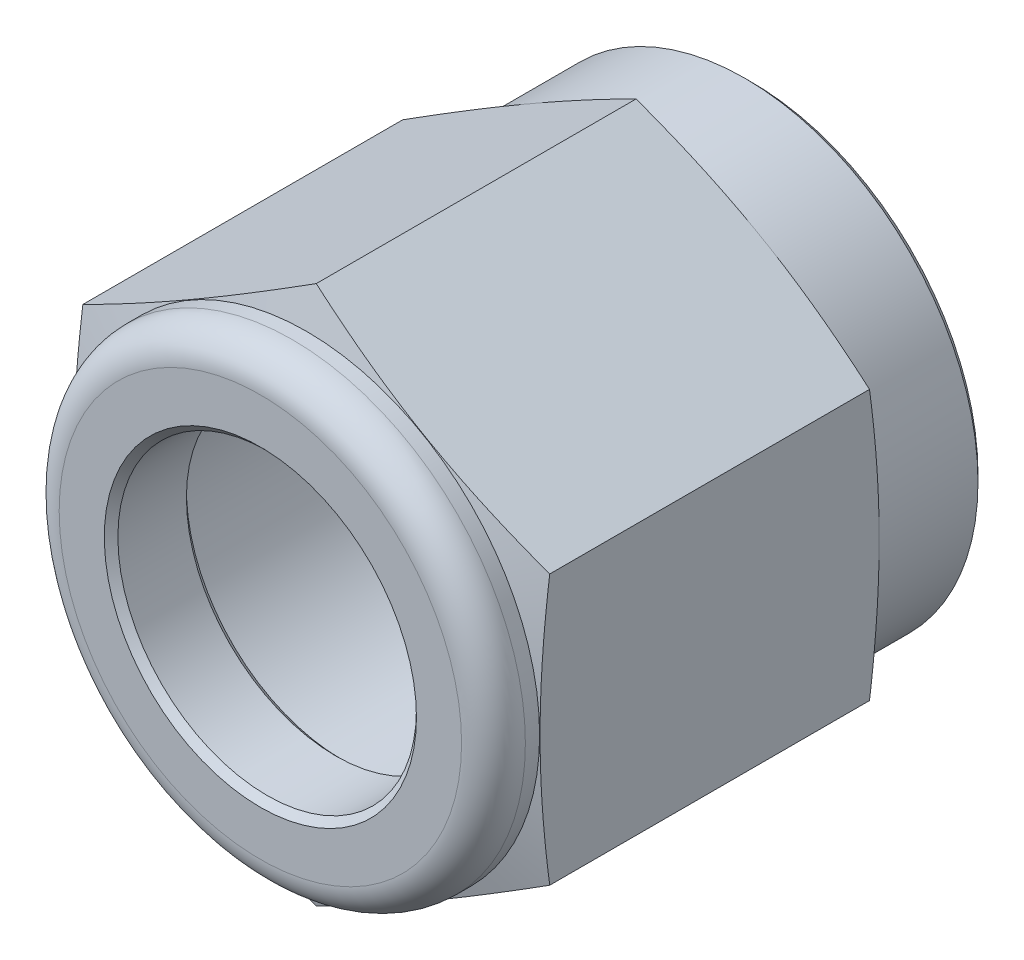
ISO-10303-21;
HEADER;
FILE_DESCRIPTION(('STEP AP214'),'2;1');
FILE_NAME('part.step','',(''),(''),'','','');
FILE_SCHEMA(('AUTOMOTIVE_DESIGN { 1 0 10303 214 1 1 1 1 }'));
ENDSEC;
DATA;
#1=APPLICATION_CONTEXT('core data for automotive mechanical design processes');
#2=APPLICATION_PROTOCOL_DEFINITION('international standard','automotive_design',2000,#1);
#3=PRODUCT_CONTEXT('',#1,'mechanical');
#4=PRODUCT('Part','Part','',(#3));
#5=PRODUCT_RELATED_PRODUCT_CATEGORY('part','',(#4));
#6=PRODUCT_DEFINITION_FORMATION('','',#4);
#7=PRODUCT_DEFINITION_CONTEXT('part definition',#1,'design');
#8=PRODUCT_DEFINITION('design','',#6,#7);
#9=PRODUCT_DEFINITION_SHAPE('','',#8);
#10=(LENGTH_UNIT() NAMED_UNIT(*) SI_UNIT(.MILLI.,.METRE.));
#11=(NAMED_UNIT(*) PLANE_ANGLE_UNIT() SI_UNIT($,.RADIAN.));
#12=(NAMED_UNIT(*) SI_UNIT($,.STERADIAN.) SOLID_ANGLE_UNIT());
#13=UNCERTAINTY_MEASURE_WITH_UNIT(LENGTH_MEASURE(1.E-05),#10,'distance_accuracy_value','');
#14=(GEOMETRIC_REPRESENTATION_CONTEXT(3) GLOBAL_UNCERTAINTY_ASSIGNED_CONTEXT((#13)) GLOBAL_UNIT_ASSIGNED_CONTEXT((#10,
#11,#12)) REPRESENTATION_CONTEXT('',''));
#15=CARTESIAN_POINT('',(0.,0.,0.));
#16=DIRECTION('',(0.,0.,1.));
#17=DIRECTION('',(1.,0.,0.));
#18=AXIS2_PLACEMENT_3D('',#15,#16,#17);
#19=CARTESIAN_POINT('',(0.,10.0893114241425,0.));
#20=DIRECTION('',(0.,0.,1.));
#21=DIRECTION('',(1.,0.,0.));
#22=AXIS2_PLACEMENT_3D('',#19,#20,#21);
#23=PLANE('',#22);
#24=CARTESIAN_POINT('',(0.,0.,0.));
#25=DIRECTION('',(0.,0.,1.));
#26=DIRECTION('',(1.,0.,0.));
#27=AXIS2_PLACEMENT_3D('',#24,#25,#26);
#28=CIRCLE('',#27,8.4709);
#29=CARTESIAN_POINT('',(8.4709,0.,0.));
#30=VERTEX_POINT('',#29);
#31=EDGE_CURVE('E266',#30,#30,#28,.F.);
#32=ORIENTED_EDGE('',*,*,#31,.T.);
#33=EDGE_LOOP('',(#32));
#34=FACE_BOUND('',#33,.T.);
#35=CARTESIAN_POINT('',(0.,0.,0.));
#36=DIRECTION('',(0.,0.,-1.));
#37=DIRECTION('',(0.,1.,0.));
#38=AXIS2_PLACEMENT_3D('',#35,#36,#37);
#39=CIRCLE('',#38,6.37041637771436);
#40=CARTESIAN_POINT('',(0.,6.37041637771436,0.));
#41=VERTEX_POINT('',#40);
#42=EDGE_CURVE('E235',#41,#41,#39,.T.);
#43=ORIENTED_EDGE('',*,*,#42,.F.);
#44=EDGE_LOOP('',(#43));
#45=FACE_BOUND('',#44,.T.);
#46=ADVANCED_FACE('F34',(#34,#45),#23,.F.);
#47=CARTESIAN_POINT('',(0.,0.,0.));
#48=DIRECTION('',(0.,0.,-1.));
#49=DIRECTION('',(0.,1.,0.));
#50=AXIS2_PLACEMENT_3D('',#47,#48,#49);
#51=CYLINDRICAL_SURFACE('',#50,8.7249);
#52=CARTESIAN_POINT('',(0.,0.,0.253999999999997));
#53=DIRECTION('',(0.,0.,1.));
#54=DIRECTION('',(0.,-1.,0.));
#55=AXIS2_PLACEMENT_3D('',#52,#53,#54);
#56=CIRCLE('',#55,8.7249);
#57=CARTESIAN_POINT('',(0.,-8.7249,0.253999999999996));
#58=VERTEX_POINT('',#57);
#59=EDGE_CURVE('E270',#58,#58,#56,.T.);
#60=ORIENTED_EDGE('',*,*,#59,.T.);
#61=EDGE_LOOP('',(#60));
#62=FACE_BOUND('',#61,.T.);
#63=CARTESIAN_POINT('',(0.,0.,3.9624));
#64=DIRECTION('',(0.,0.,-1.));
#65=DIRECTION('',(0.,1.,0.));
#66=AXIS2_PLACEMENT_3D('',#63,#64,#65);
#67=CIRCLE('',#66,8.7249);
#68=CARTESIAN_POINT('',(0.,8.7249,3.9624));
#69=VERTEX_POINT('',#68);
#70=EDGE_CURVE('E223',#69,#69,#67,.T.);
#71=ORIENTED_EDGE('',*,*,#70,.T.);
#72=EDGE_LOOP('',(#71));
#73=FACE_BOUND('',#72,.T.);
#74=ADVANCED_FACE('F134',(#62,#73),#51,.T.);
#75=CARTESIAN_POINT('',(0.,0.,4.32799293924278));
#76=DIRECTION('',(0.,0.,1.));
#77=DIRECTION('',(0.,-1.,0.));
#78=AXIS2_PLACEMENT_3D('',#75,#76,#77);
#79=CONICAL_SURFACE('',#78,10.0893114241425,1.30899693899575);
#80=ORIENTED_EDGE('',*,*,#70,.F.);
#81=EDGE_LOOP('',(#80));
#82=FACE_BOUND('',#81,.T.);
#83=CARTESIAN_POINT('',(8.73760000000001,-13.3370916503586,5.89685731332786));
#84=CARTESIAN_POINT('',(8.73760000000001,-12.9407811423855,5.80805498338109));
#85=CARTESIAN_POINT('',(8.73760000000001,-12.5442225359315,5.72034003171987));
#86=CARTESIAN_POINT('',(8.73760000000001,-11.7504872986012,5.54767181352333));
#87=CARTESIAN_POINT('',(8.73760000000001,-11.3533106417559,5.46271866650578));
#88=CARTESIAN_POINT('',(8.73760000000001,-10.5578606060448,5.29608683430577));
#89=CARTESIAN_POINT('',(8.73760000000001,-10.1595865326222,5.21441145291669));
#90=CARTESIAN_POINT('',(8.73760000000001,-9.36220884131074,5.05521800996621));
#91=CARTESIAN_POINT('',(8.73760000000001,-8.96310523046937,4.97769991323486));
#92=CARTESIAN_POINT('',(8.73760000000001,-8.16710987431472,4.82840874260179));
#93=CARTESIAN_POINT('',(8.73760000000001,-7.77022582564859,4.75659483338334));
#94=CARTESIAN_POINT('',(8.73760000000001,-6.97537471360975,4.61924538314826));
#95=CARTESIAN_POINT('',(8.73760000000001,-6.57740767430246,4.5537097037742));
#96=CARTESIAN_POINT('',(8.73760000000001,-5.78031425062835,4.43039397319472));
#97=CARTESIAN_POINT('',(8.73760000000001,-5.38118801735821,4.37261295380368));
#98=CARTESIAN_POINT('',(8.73760000000001,-4.58166571534919,4.26651068734319));
#99=CARTESIAN_POINT('',(8.73760000000001,-4.18126964546581,4.21818944880213));
#100=CARTESIAN_POINT('',(8.73760000000001,-3.37469361192982,4.13237672046867));
#101=CARTESIAN_POINT('',(8.73760000000001,-2.96849966783886,4.0950146852137));
#102=CARTESIAN_POINT('',(8.73760000000001,-2.15509231097565,4.03369886687758));
#103=CARTESIAN_POINT('',(8.73760000000001,-1.74787892179762,4.00974477630997));
#104=CARTESIAN_POINT('',(8.73760000000001,-0.933023182699148,3.97664203305042));
#105=CARTESIAN_POINT('',(8.73760000000001,-0.525381110543666,3.96748668059922));
#106=CARTESIAN_POINT('',(8.73760000000001,0.289959324217701,3.96454411633489));
#107=CARTESIAN_POINT('',(8.73760000000001,0.69765768677999,3.9707568926856));
#108=CARTESIAN_POINT('',(8.73760000000001,1.51402197512032,3.99820117933298));
#109=CARTESIAN_POINT('',(8.73760000000001,1.92268603092988,4.01948720101598));
#110=CARTESIAN_POINT('',(8.73760000000001,2.73905201861394,4.07586371172871));
#111=CARTESIAN_POINT('',(8.73760000000001,3.14675392902682,4.11095450581383));
#112=CARTESIAN_POINT('',(8.73760000000001,3.96119243017671,4.19316998744099));
#113=CARTESIAN_POINT('',(8.73760000000001,4.36792821756477,4.24030251132754));
#114=CARTESIAN_POINT('',(8.73760000000001,5.18009112222811,4.34464260955491));
#115=CARTESIAN_POINT('',(8.73760000000001,5.58551823540192,4.40185021544062));
#116=CARTESIAN_POINT('',(8.73760000000001,6.36795436626479,4.5203990901853));
#117=CARTESIAN_POINT('',(8.73760000000001,6.74504523337188,4.58120559737562));
#118=CARTESIAN_POINT('',(8.73760000000001,7.4982344832071,4.70871011316648));
#119=CARTESIAN_POINT('',(8.7376,7.87433283869598,4.77540828176568));
#120=CARTESIAN_POINT('',(8.7376,8.625673836263,4.91362100326598));
#121=CARTESIAN_POINT('',(8.7376,9.00091639891937,4.98513598577669));
#122=CARTESIAN_POINT('',(8.7376,9.75063302919414,5.13209774282694));
#123=CARTESIAN_POINT('',(8.7376,10.1251070868206,5.20754456815523));
#124=CARTESIAN_POINT('',(8.7376,10.8734738969219,5.36167634347155));
#125=CARTESIAN_POINT('',(8.7376,11.2473665002567,5.44036201560457));
#126=CARTESIAN_POINT('',(8.7376,11.9945830311543,5.6003925296571));
#127=CARTESIAN_POINT('',(8.7376,12.3679069554036,5.68173738700972));
#128=CARTESIAN_POINT('',(8.7376,13.4871026547804,5.92904387550513));
#129=CARTESIAN_POINT('',(8.7376,14.2322488355346,6.09828795775638));
#130=CARTESIAN_POINT('',(8.7376,15.7138014365573,6.44119022090255));
#131=CARTESIAN_POINT('',(8.7376,16.4502217733153,6.61478866690138));
#132=CARTESIAN_POINT('',(8.7376,17.9220354193814,6.96633714736884));
#133=CARTESIAN_POINT('',(8.7376,18.6574287098006,7.14428726078534));
#134=CARTESIAN_POINT('',(8.7376,20.1265247542985,7.50317870586105));
#135=CARTESIAN_POINT('',(8.7376,20.8602284751811,7.6841160897037));
#136=CARTESIAN_POINT('',(8.7376,22.326996556865,8.04846329476318));
#137=CARTESIAN_POINT('',(8.7376,23.0600609379207,8.23187303438332));
#138=CARTESIAN_POINT('',(8.7376,23.792902457494,8.41615909090725));
#139=B_SPLINE_CURVE_WITH_KNOTS('',3,(#83,#84,#85,#86,#87,#88,#89,#90,#91,#92,#93,#94,#95,#96,
#97,#98,#99,#100,#101,#102,#103,#104,#105,#106,#107,#108,#109,#110,#111,#112,#113,#114,#115,
#116,#117,#118,#119,#120,#121,#122,#123,#124,#125,#126,#127,#128,#129,#130,#131,#132,#133,#134,
#135,#136,#137,#138),.UNSPECIFIED.,.F.,.F.,(4,2,2,2,2,2,2,2,2,2,2,2,2,2,2,2,2,2,2,2,2,2,2,2,2,2,
2,4),(0.,1.21841822105609,2.43688909946208,3.65655876434302,4.87621810938722,6.086164475953,
7.29608417200858,8.50585266623226,9.71562225110786,10.9391543675726,12.1626584234379,
13.3856084130865,14.60855746085,15.8359519593774,17.0633735821714,18.2915960125055,
19.5198222884488,20.6656532192005,21.8115152766212,22.9574796686759,24.1034588671537,
25.2496949762232,26.3959377388881,28.6882685756882,30.95806863218,33.2279098979348,
35.4949596578413,37.7619347792032),.UNSPECIFIED.);
#140=CARTESIAN_POINT('',(8.73760000000001,-5.04465571207125,4.32799293924278));
#141=VERTEX_POINT('',#140);
#142=CARTESIAN_POINT('',(8.73760000000001,5.04465571207128,4.32799293924279));
#143=VERTEX_POINT('',#142);
#144=EDGE_CURVE('E106',#141,#143,#139,.T.);
#145=ORIENTED_EDGE('',*,*,#144,.F.);
#146=CARTESIAN_POINT('',(-0.000199999999990534,-10.0894268941964,4.32802387988161));
#147=CARTESIAN_POINT('',(0.362667161543261,-9.87992544079931,4.27186496625331));
#148=CARTESIAN_POINT('',(0.726192234859543,-9.67004414186298,4.22088197305859));
#149=CARTESIAN_POINT('',(1.45452617534357,-9.24954034526459,4.13130967467495));
#150=CARTESIAN_POINT('',(1.81933550330346,-9.03891758156405,4.09272540336213));
#151=CARTESIAN_POINT('',(2.54802615381984,-8.61820783833246,4.03020303584528));
#152=CARTESIAN_POINT('',(2.91190254916345,-8.40812370352907,4.0061903803857));
#153=CARTESIAN_POINT('',(3.64011936529056,-7.98768752870968,3.97399187083098));
#154=CARTESIAN_POINT('',(4.00445968264528,-7.77733554840829,3.96580295474388));
#155=CARTESIAN_POINT('',(4.73314031735474,-7.35663158780552,3.96580295474388));
#156=CARTESIAN_POINT('',(5.09748063470946,-7.14627960750414,3.97399187083098));
#157=CARTESIAN_POINT('',(5.82569745083657,-6.72584343268474,4.0061903803857));
#158=CARTESIAN_POINT('',(6.18957384618018,-6.51575929788135,4.03020303584528));
#159=CARTESIAN_POINT('',(6.91826449669656,-6.09504955464976,4.09272540336214));
#160=CARTESIAN_POINT('',(7.28307382465645,-5.88442679094923,4.13130967467496));
#161=CARTESIAN_POINT('',(8.01140776514048,-5.46392299435084,4.22088197305859));
#162=CARTESIAN_POINT('',(8.37493283845676,-5.2540416954145,4.27186496625331));
#163=CARTESIAN_POINT('',(8.73780000000001,-5.04454024201743,4.32802387988161));
#164=B_SPLINE_CURVE_WITH_KNOTS('',3,(#146,#147,#148,#149,#150,#151,#152,#153,#154,#155,#156,
#157,#158,#159,#160,#161,#162,#163),.UNSPECIFIED.,.F.,.F.,(4,2,2,2,2,2,2,2,4),(0.,
1.26831537188702,2.53714503060925,3.79942643103211,5.06146354768364,6.32350066433517,
7.58578206475804,8.85461172348026,10.1229270953673),.UNSPECIFIED.);
#165=CARTESIAN_POINT('',(0.,-10.0893114241425,4.32799293924278));
#166=VERTEX_POINT('',#165);
#167=EDGE_CURVE('E145',#166,#141,#164,.T.);
#168=ORIENTED_EDGE('',*,*,#167,.F.);
#169=CARTESIAN_POINT('',(-8.7378,-5.04454024201743,4.32802387988161));
#170=CARTESIAN_POINT('',(-8.37493283845675,-5.25404169541451,4.27186496625331));
#171=CARTESIAN_POINT('',(-8.01140776514046,-5.46392299435084,4.22088197305859));
#172=CARTESIAN_POINT('',(-7.28307382465644,-5.88442679094923,4.13130967467495));
#173=CARTESIAN_POINT('',(-6.91826449669655,-6.09504955464976,4.09272540336213));
#174=CARTESIAN_POINT('',(-6.18957384618017,-6.51575929788136,4.03020303584528));
#175=CARTESIAN_POINT('',(-5.82569745083655,-6.72584343268474,4.00619038038569));
#176=CARTESIAN_POINT('',(-5.09748063470945,-7.14627960750414,3.97399187083098));
#177=CARTESIAN_POINT('',(-4.73314031735472,-7.35663158780552,3.96580295474387));
#178=CARTESIAN_POINT('',(-4.00445968264527,-7.77733554840829,3.96580295474387));
#179=CARTESIAN_POINT('',(-3.64011936529054,-7.98768752870968,3.97399187083098));
#180=CARTESIAN_POINT('',(-2.91190254916344,-8.40812370352907,4.00619038038569));
#181=CARTESIAN_POINT('',(-2.54802615381982,-8.61820783833246,4.03020303584528));
#182=CARTESIAN_POINT('',(-1.81933550330344,-9.03891758156405,4.09272540336213));
#183=CARTESIAN_POINT('',(-1.45452617534355,-9.24954034526459,4.13130967467495));
#184=CARTESIAN_POINT('',(-0.726192234859525,-9.67004414186298,4.22088197305859));
#185=CARTESIAN_POINT('',(-0.362667161543244,-9.87992544079931,4.2718649662533));
#186=CARTESIAN_POINT('',(0.000200000000008451,-10.0894268941964,4.32802387988161));
#187=B_SPLINE_CURVE_WITH_KNOTS('',3,(#169,#170,#171,#172,#173,#174,#175,#176,#177,#178,#179,
#180,#181,#182,#183,#184,#185,#186),.UNSPECIFIED.,.F.,.F.,(4,2,2,2,2,2,2,2,4),(0.,
1.26831537188702,2.53714503060925,3.79942643103211,5.06146354768364,6.32350066433517,
7.58578206475804,8.85461172348026,10.1229270953673),.UNSPECIFIED.);
#188=CARTESIAN_POINT('',(-8.7376,-5.04465571207127,4.32799293924278));
#189=VERTEX_POINT('',#188);
#190=EDGE_CURVE('E153',#189,#166,#187,.T.);
#191=ORIENTED_EDGE('',*,*,#190,.F.);
#192=CARTESIAN_POINT('',(-8.7376,-13.3370906470932,5.8968570884631));
#193=CARTESIAN_POINT('',(-8.7376,-12.940780179666,5.80805476960499));
#194=CARTESIAN_POINT('',(-8.7376,-12.5442216137727,5.72033982899216));
#195=CARTESIAN_POINT('',(-8.7376,-11.7504864576168,5.54767163272845));
#196=CARTESIAN_POINT('',(-8.7376,-11.3533098413851,5.46271849659535));
#197=CARTESIAN_POINT('',(-8.7376,-10.5578598871094,5.29608668594657));
#198=CARTESIAN_POINT('',(-8.7376,-10.1595858545087,5.21441131522321));
#199=CARTESIAN_POINT('',(-8.7376,-9.36220824494286,5.05521789321654));
#200=CARTESIAN_POINT('',(-8.7376,-8.96310467502522,4.97769980676328));
#201=CARTESIAN_POINT('',(-8.7376,-8.16710939978457,4.82840865588055));
#202=CARTESIAN_POINT('',(-8.7376,-7.7702253911058,4.75659475614855));
#203=CARTESIAN_POINT('',(-8.7376,-6.9753743592185,4.61924532405619));
#204=CARTESIAN_POINT('',(-8.7376,-6.57740736007538,4.55370965333843));
#205=CARTESIAN_POINT('',(-8.7376,-5.78031401692537,4.43039393886135));
#206=CARTESIAN_POINT('',(-8.7376,-5.38118782401505,4.37261292691702));
#207=CARTESIAN_POINT('',(-8.7376,-4.58166560298533,4.2665106736597));
#208=CARTESIAN_POINT('',(-8.7376,-4.18126957372144,4.21818944087507));
#209=CARTESIAN_POINT('',(-8.7376,-3.374693626039,4.13237672226692));
#210=CARTESIAN_POINT('',(-8.7376,-2.96849972719703,4.09501469084387));
#211=CARTESIAN_POINT('',(-8.7376,-2.15509246103131,4.03369887703453));
#212=CARTESIAN_POINT('',(-8.7376,-1.74787911730177,4.00974478716203));
#213=CARTESIAN_POINT('',(-8.7376,-0.933023469082971,3.97664204177805));
#214=CARTESIAN_POINT('',(-8.7376,-0.525381442358603,3.96748668651027));
#215=CARTESIAN_POINT('',(-8.7376,0.289958901706638,3.96454411314652));
#216=CARTESIAN_POINT('',(-8.7376,0.697657219003915,3.97075688321431));
#217=CARTESIAN_POINT('',(-8.7376,1.51402141682223,3.9982011542835));
#218=CARTESIAN_POINT('',(-8.7376,1.92268542737625,4.01948716665424));
#219=CARTESIAN_POINT('',(-8.7376,2.73905132495593,4.07586365650009));
#220=CARTESIAN_POINT('',(-8.7376,3.14675319052,4.11095443903037));
#221=CARTESIAN_POINT('',(-8.7376,3.96119160223552,4.1931698960832));
#222=CARTESIAN_POINT('',(-8.7376,4.36792734503854,4.24030240694663));
#223=CARTESIAN_POINT('',(-8.7376,5.18009016083139,4.34464247832279));
#224=CARTESIAN_POINT('',(-8.7376,5.58551722971973,4.40185007038043));
#225=CARTESIAN_POINT('',(-8.7376,6.36795331737117,4.52039892444217));
#226=CARTESIAN_POINT('',(-8.7376,6.74504418541614,4.58120542560283));
#227=CARTESIAN_POINT('',(-8.7376,7.49823343703124,4.70870993043118));
#228=CARTESIAN_POINT('',(-8.7376,7.87433179336209,4.77540809409762));
#229=CARTESIAN_POINT('',(-8.7376,8.62567279252224,4.91362080663917));
#230=CARTESIAN_POINT('',(-8.7376,9.0009153559297,4.98513578512419));
#231=CARTESIAN_POINT('',(-8.7376,9.75063198760383,5.13209753485493));
#232=CARTESIAN_POINT('',(-8.7376,10.1251060458785,5.20754435688943));
#233=CARTESIAN_POINT('',(-8.7376,10.873472857352,5.36167612623897));
#234=CARTESIAN_POINT('',(-8.7376,11.2473654614104,5.44036179570061));
#235=CARTESIAN_POINT('',(-8.7376,11.9945819936728,5.60039230488276));
#236=CARTESIAN_POINT('',(-8.73760000000001,12.3679059185631,5.6817371600364));
#237=CARTESIAN_POINT('',(-8.73760000000001,13.4871016197368,5.92904364249242));
#238=CARTESIAN_POINT('',(-8.73760000000001,14.2322478015412,6.09828772146485));
#239=CARTESIAN_POINT('',(-8.73760000000001,15.7138004057436,6.44118997934319));
#240=CARTESIAN_POINT('',(-8.73760000000001,16.4502207446304,6.61478842335406));
#241=CARTESIAN_POINT('',(-8.73760000000001,17.9220343948174,6.96633690049325));
#242=CARTESIAN_POINT('',(-8.73760000000001,18.6574276872287,7.14428701256947));
#243=CARTESIAN_POINT('',(-8.73760000000001,20.1265237349962,7.50317845525574));
#244=CARTESIAN_POINT('',(-8.73760000000001,20.8602274571573,7.68411583804604));
#245=CARTESIAN_POINT('',(-8.73760000000001,22.3269955413158,8.04846304131112));
#246=CARTESIAN_POINT('',(-8.73760000000001,23.0600599235677,8.23187278018918));
#247=CARTESIAN_POINT('',(-8.73760000000001,23.7929014443134,8.41615883606714));
#248=B_SPLINE_CURVE_WITH_KNOTS('',3,(#192,#193,#194,#195,#196,#197,#198,#199,#200,#201,#202,
#203,#204,#205,#206,#207,#208,#209,#210,#211,#212,#213,#214,#215,#216,#217,#218,#219,#220,#221,
#222,#223,#224,#225,#226,#227,#228,#229,#230,#231,#232,#233,#234,#235,#236,#237,#238,#239,#240,
#241,#242,#243,#244,#245,#246,#247),.UNSPECIFIED.,.F.,.F.,(4,2,2,2,2,2,2,2,2,2,2,2,2,2,2,2,2,2,
2,2,2,2,2,2,2,2,2,4),(0.,1.21841809508768,2.43688884751804,3.65655838600311,4.87621760465211,
6.08616384811106,7.29608342106709,8.50585179228126,9.71562125414385,10.9391532344459,
12.1626571541688,13.3856070078496,14.6085559196382,15.8359502811954,17.0633717670016,
18.2915940599856,19.5198201985816,20.665651129209,21.8115131865193,22.9574775785168,
24.1034567769433,25.2496928864825,26.3959356496195,28.6882664872994,30.9580665486345,
33.2279078192492,35.4949575821224,37.7619327064237),.UNSPECIFIED.);
#249=CARTESIAN_POINT('',(-8.7376,5.04465571207126,4.32799293924278));
#250=VERTEX_POINT('',#249);
#251=EDGE_CURVE('E88',#250,#189,#248,.F.);
#252=ORIENTED_EDGE('',*,*,#251,.F.);
#253=CARTESIAN_POINT('',(0.000200000000000009,10.0894268941964,4.32802387988161));
#254=CARTESIAN_POINT('',(-0.362667161543252,9.87992544079931,4.27186496625331));
#255=CARTESIAN_POINT('',(-0.726192234859533,9.67004414186298,4.22088197305859));
#256=CARTESIAN_POINT('',(-1.45452617534356,9.24954034526459,4.13130967467496));
#257=CARTESIAN_POINT('',(-1.81933550330345,9.03891758156405,4.09272540336214));
#258=CARTESIAN_POINT('',(-2.54802615381983,8.61820783833246,4.03020303584528));
#259=CARTESIAN_POINT('',(-2.91190254916344,8.40812370352907,4.0061903803857));
#260=CARTESIAN_POINT('',(-3.64011936529055,7.98768752870968,3.97399187083098));
#261=CARTESIAN_POINT('',(-4.00445968264527,7.77733554840829,3.96580295474388));
#262=CARTESIAN_POINT('',(-4.73314031735473,7.35663158780552,3.96580295474388));
#263=CARTESIAN_POINT('',(-5.09748063470945,7.14627960750414,3.97399187083098));
#264=CARTESIAN_POINT('',(-5.82569745083656,6.72584343268474,4.0061903803857));
#265=CARTESIAN_POINT('',(-6.18957384618017,6.51575929788136,4.03020303584528));
#266=CARTESIAN_POINT('',(-6.91826449669655,6.09504955464976,4.09272540336214));
#267=CARTESIAN_POINT('',(-7.28307382465645,5.88442679094923,4.13130967467496));
#268=CARTESIAN_POINT('',(-8.01140776514047,5.46392299435084,4.22088197305859));
#269=CARTESIAN_POINT('',(-8.37493283845675,5.25404169541451,4.27186496625331));
#270=CARTESIAN_POINT('',(-8.7378,5.04454024201743,4.32802387988161));
#271=B_SPLINE_CURVE_WITH_KNOTS('',3,(#253,#254,#255,#256,#257,#258,#259,#260,#261,#262,#263,
#264,#265,#266,#267,#268,#269,#270),.UNSPECIFIED.,.F.,.F.,(4,2,2,2,2,2,2,2,4),(0.,
1.26831537188702,2.53714503060925,3.79942643103211,5.06146354768364,6.32350066433517,
7.58578206475803,8.85461172348026,10.1229270953673),.UNSPECIFIED.);
#272=CARTESIAN_POINT('',(0.,10.0893114241425,4.32799293924278));
#273=VERTEX_POINT('',#272);
#274=EDGE_CURVE('E85',#273,#250,#271,.T.);
#275=ORIENTED_EDGE('',*,*,#274,.F.);
#276=CARTESIAN_POINT('',(8.73780000000001,5.04454024201744,4.32802387988161));
#277=CARTESIAN_POINT('',(8.37493283845675,5.25404169541451,4.27186496625331));
#278=CARTESIAN_POINT('',(8.01140776514047,5.46392299435084,4.22088197305859));
#279=CARTESIAN_POINT('',(7.28307382465645,5.88442679094923,4.13130967467496));
#280=CARTESIAN_POINT('',(6.91826449669655,6.09504955464976,4.09272540336214));
#281=CARTESIAN_POINT('',(6.18957384618018,6.51575929788136,4.03020303584528));
#282=CARTESIAN_POINT('',(5.82569745083656,6.72584343268474,4.0061903803857));
#283=CARTESIAN_POINT('',(5.09748063470946,7.14627960750414,3.97399187083098));
#284=CARTESIAN_POINT('',(4.73314031735473,7.35663158780552,3.96580295474388));
#285=CARTESIAN_POINT('',(4.00445968264528,7.77733554840829,3.96580295474388));
#286=CARTESIAN_POINT('',(3.64011936529055,7.98768752870968,3.97399187083098));
#287=CARTESIAN_POINT('',(2.91190254916345,8.40812370352907,4.0061903803857));
#288=CARTESIAN_POINT('',(2.54802615381983,8.61820783833246,4.03020303584528));
#289=CARTESIAN_POINT('',(1.81933550330345,9.03891758156405,4.09272540336214));
#290=CARTESIAN_POINT('',(1.45452617534356,9.24954034526459,4.13130967467496));
#291=CARTESIAN_POINT('',(0.726192234859534,9.67004414186298,4.22088197305859));
#292=CARTESIAN_POINT('',(0.362667161543253,9.87992544079931,4.27186496625331));
#293=CARTESIAN_POINT('',(-0.000199999999998106,10.0894268941964,4.32802387988161));
#294=B_SPLINE_CURVE_WITH_KNOTS('',3,(#276,#277,#278,#279,#280,#281,#282,#283,#284,#285,#286,
#287,#288,#289,#290,#291,#292,#293),.UNSPECIFIED.,.F.,.F.,(4,2,2,2,2,2,2,2,4),(0.,
1.26831537188702,2.53714503060925,3.79942643103211,5.06146354768364,6.32350066433517,
7.58578206475803,8.85461172348026,10.1229270953673),.UNSPECIFIED.);
#295=EDGE_CURVE('E57',#143,#273,#294,.T.);
#296=ORIENTED_EDGE('',*,*,#295,.F.);
#297=EDGE_LOOP('',(#145,#168,#191,#252,#275,#296));
#298=FACE_BOUND('',#297,.T.);
#299=ADVANCED_FACE('F86',(#82,#298),#79,.T.);
#300=CARTESIAN_POINT('',(8.73760000000001,5.04465571207128,18.3896));
#301=DIRECTION('',(-0.499999999999999,-0.866025403784439,0.));
#302=DIRECTION('',(0.866025403784439,-0.499999999999999,0.));
#303=AXIS2_PLACEMENT_3D('',#300,#301,#302);
#304=PLANE('',#303);
#305=DIRECTION('',(0.,0.,-1.));
#306=VECTOR('',#305,1.);
#307=CARTESIAN_POINT('',(0.,10.0893114241425,18.3896));
#308=LINE('',#307,#306);
#309=CARTESIAN_POINT('',(0.,10.0893114241425,16.2968070607572));
#310=VERTEX_POINT('',#309);
#311=EDGE_CURVE('E99',#310,#273,#308,.T.);
#312=ORIENTED_EDGE('',*,*,#311,.F.);
#313=CARTESIAN_POINT('',(-0.0002,10.0894268941964,16.2967761201184));
#314=CARTESIAN_POINT('',(0.362667161543252,9.87992544079931,16.3529350337467));
#315=CARTESIAN_POINT('',(0.726192234859533,9.67004414186298,16.4039180269414));
#316=CARTESIAN_POINT('',(1.45452617534356,9.24954034526459,16.493490325325));
#317=CARTESIAN_POINT('',(1.81933550330345,9.03891758156405,16.5320745966379));
#318=CARTESIAN_POINT('',(2.54802615381983,8.61820783833246,16.5945969641547));
#319=CARTESIAN_POINT('',(2.91190254916345,8.40812370352907,16.6186096196143));
#320=CARTESIAN_POINT('',(3.64011936529055,7.98768752870968,16.650808129169));
#321=CARTESIAN_POINT('',(4.00445968264528,7.77733554840829,16.6589970452561));
#322=CARTESIAN_POINT('',(4.73314031735473,7.35663158780552,16.6589970452561));
#323=CARTESIAN_POINT('',(5.09748063470946,7.14627960750414,16.650808129169));
#324=CARTESIAN_POINT('',(5.82569745083656,6.72584343268475,16.6186096196143));
#325=CARTESIAN_POINT('',(6.18957384618017,6.51575929788136,16.5945969641547));
#326=CARTESIAN_POINT('',(6.91826449669655,6.09504955464976,16.5320745966379));
#327=CARTESIAN_POINT('',(7.28307382465645,5.88442679094923,16.493490325325));
#328=CARTESIAN_POINT('',(8.01140776514047,5.46392299435084,16.4039180269414));
#329=CARTESIAN_POINT('',(8.37493283845675,5.25404169541451,16.3529350337467));
#330=CARTESIAN_POINT('',(8.73780000000001,5.04454024201744,16.2967761201184));
#331=B_SPLINE_CURVE_WITH_KNOTS('',3,(#313,#314,#315,#316,#317,#318,#319,#320,#321,#322,#323,
#324,#325,#326,#327,#328,#329,#330),.UNSPECIFIED.,.F.,.F.,(4,2,2,2,2,2,2,2,4),(0.,
1.26831537188702,2.53714503060925,3.79942643103211,5.06146354768364,6.32350066433517,
7.58578206475804,8.85461172348026,10.1229270953673),.UNSPECIFIED.);
#332=CARTESIAN_POINT('',(8.73760000000001,5.04465571207126,16.2968070607572));
#333=VERTEX_POINT('',#332);
#334=EDGE_CURVE('E190',#310,#333,#331,.T.);
#335=ORIENTED_EDGE('',*,*,#334,.T.);
#336=DIRECTION('',(0.,0.,-1.));
#337=VECTOR('',#336,1.);
#338=CARTESIAN_POINT('',(8.73760000000001,5.04465571207128,18.3896));
#339=LINE('',#338,#337);
#340=EDGE_CURVE('E101',#333,#143,#339,.T.);
#341=ORIENTED_EDGE('',*,*,#340,.T.);
#342=ORIENTED_EDGE('',*,*,#295,.T.);
#343=EDGE_LOOP('',(#312,#335,#341,#342));
#344=FACE_BOUND('',#343,.T.);
#345=ADVANCED_FACE('F97',(#344),#304,.F.);
#346=CARTESIAN_POINT('',(0.,10.0893114241425,18.3896));
#347=DIRECTION('',(0.5,-0.866025403784439,0.));
#348=DIRECTION('',(0.866025403784439,0.5,0.));
#349=AXIS2_PLACEMENT_3D('',#346,#347,#348);
#350=PLANE('',#349);
#351=DIRECTION('',(0.,0.,-1.));
#352=VECTOR('',#351,1.);
#353=CARTESIAN_POINT('',(-8.7376,5.04465571207127,18.3896));
#354=LINE('',#353,#352);
#355=CARTESIAN_POINT('',(-8.7376,5.04465571207126,16.2968070607572));
#356=VERTEX_POINT('',#355);
#357=EDGE_CURVE('E107',#356,#250,#354,.T.);
#358=ORIENTED_EDGE('',*,*,#357,.F.);
#359=CARTESIAN_POINT('',(-8.7378,5.04454024201744,16.2967761201184));
#360=CARTESIAN_POINT('',(-8.37493283845675,5.25404169541451,16.3529350337467));
#361=CARTESIAN_POINT('',(-8.01140776514047,5.46392299435084,16.4039180269414));
#362=CARTESIAN_POINT('',(-7.28307382465645,5.88442679094923,16.493490325325));
#363=CARTESIAN_POINT('',(-6.91826449669655,6.09504955464976,16.5320745966379));
#364=CARTESIAN_POINT('',(-6.18957384618017,6.51575929788136,16.5945969641547));
#365=CARTESIAN_POINT('',(-5.82569745083656,6.72584343268474,16.6186096196143));
#366=CARTESIAN_POINT('',(-5.09748063470946,7.14627960750414,16.650808129169));
#367=CARTESIAN_POINT('',(-4.73314031735473,7.35663158780552,16.6589970452561));
#368=CARTESIAN_POINT('',(-4.00445968264527,7.77733554840829,16.6589970452561));
#369=CARTESIAN_POINT('',(-3.64011936529055,7.98768752870968,16.650808129169));
#370=CARTESIAN_POINT('',(-2.91190254916344,8.40812370352907,16.6186096196143));
#371=CARTESIAN_POINT('',(-2.54802615381983,8.61820783833246,16.5945969641547));
#372=CARTESIAN_POINT('',(-1.81933550330345,9.03891758156405,16.5320745966379));
#373=CARTESIAN_POINT('',(-1.45452617534355,9.24954034526459,16.493490325325));
#374=CARTESIAN_POINT('',(-0.726192234859532,9.67004414186298,16.4039180269414));
#375=CARTESIAN_POINT('',(-0.362667161543252,9.87992544079931,16.3529350337467));
#376=CARTESIAN_POINT('',(0.000199999999999281,10.0894268941964,16.2967761201184));
#377=B_SPLINE_CURVE_WITH_KNOTS('',3,(#359,#360,#361,#362,#363,#364,#365,#366,#367,#368,#369,
#370,#371,#372,#373,#374,#375,#376),.UNSPECIFIED.,.F.,.F.,(4,2,2,2,2,2,2,2,4),(0.,
1.26831537188702,2.53714503060925,3.79942643103211,5.06146354768364,6.32350066433517,
7.58578206475804,8.85461172348026,10.1229270953673),.UNSPECIFIED.);
#378=EDGE_CURVE('E105',#356,#310,#377,.T.);
#379=ORIENTED_EDGE('',*,*,#378,.T.);
#380=ORIENTED_EDGE('',*,*,#311,.T.);
#381=ORIENTED_EDGE('',*,*,#274,.T.);
#382=EDGE_LOOP('',(#358,#379,#380,#381));
#383=FACE_BOUND('',#382,.T.);
#384=ADVANCED_FACE('F104',(#383),#350,.F.);
#385=CARTESIAN_POINT('',(-8.7376,5.04465571207127,18.3896));
#386=DIRECTION('',(1.,0.,0.));
#387=DIRECTION('',(0.,1.,0.));
#388=AXIS2_PLACEMENT_3D('',#385,#386,#387);
#389=PLANE('',#388);
#390=DIRECTION('',(0.,0.,-1.));
#391=VECTOR('',#390,1.);
#392=CARTESIAN_POINT('',(-8.7376,-5.04465571207127,18.3896));
#393=LINE('',#392,#391);
#394=CARTESIAN_POINT('',(-8.7376,-5.04465571207128,16.2968070607572));
#395=VERTEX_POINT('',#394);
#396=EDGE_CURVE('E111',#395,#189,#393,.T.);
#397=ORIENTED_EDGE('',*,*,#396,.F.);
#398=CARTESIAN_POINT('',(-8.7376,-13.3370906470932,14.7279429115369));
#399=CARTESIAN_POINT('',(-8.7376,-12.940780179666,14.816745230395));
#400=CARTESIAN_POINT('',(-8.7376,-12.5442216137727,14.9044601710078));
#401=CARTESIAN_POINT('',(-8.7376,-11.7504864576168,15.0771283672715));
#402=CARTESIAN_POINT('',(-8.7376,-11.3533098413851,15.1620815034046));
#403=CARTESIAN_POINT('',(-8.7376,-10.5578598871094,15.3287133140534));
#404=CARTESIAN_POINT('',(-8.7376,-10.1595858545087,15.4103886847768));
#405=CARTESIAN_POINT('',(-8.7376,-9.36220824494286,15.5695821067835));
#406=CARTESIAN_POINT('',(-8.7376,-8.96310467502522,15.6471001932367));
#407=CARTESIAN_POINT('',(-8.7376,-8.16710939978457,15.7963913441194));
#408=CARTESIAN_POINT('',(-8.7376,-7.7702253911058,15.8682052438514));
#409=CARTESIAN_POINT('',(-8.7376,-6.97537435921849,16.0055546759438));
#410=CARTESIAN_POINT('',(-8.7376,-6.57740736007538,16.0710903466616));
#411=CARTESIAN_POINT('',(-8.7376,-5.78031401692537,16.1944060611386));
#412=CARTESIAN_POINT('',(-8.7376,-5.38118782401505,16.252187073083));
#413=CARTESIAN_POINT('',(-8.7376,-4.58166560298533,16.3582893263403));
#414=CARTESIAN_POINT('',(-8.7376,-4.18126957372144,16.4066105591249));
#415=CARTESIAN_POINT('',(-8.7376,-3.374693626039,16.4924232777331));
#416=CARTESIAN_POINT('',(-8.7376,-2.96849972719703,16.5297853091561));
#417=CARTESIAN_POINT('',(-8.7376,-2.15509246103131,16.5911011229655));
#418=CARTESIAN_POINT('',(-8.7376,-1.74787911730177,16.615055212838));
#419=CARTESIAN_POINT('',(-8.7376,-0.933023469082971,16.6481579582219));
#420=CARTESIAN_POINT('',(-8.7376,-0.525381442358602,16.6573133134897));
#421=CARTESIAN_POINT('',(-8.7376,0.28995890170664,16.6602558868535));
#422=CARTESIAN_POINT('',(-8.7376,0.697657219003917,16.6540431167857));
#423=CARTESIAN_POINT('',(-8.7376,1.51402141682224,16.6265988457165));
#424=CARTESIAN_POINT('',(-8.7376,1.92268542737625,16.6053128333458));
#425=CARTESIAN_POINT('',(-8.7376,2.73905132495593,16.5489363434999));
#426=CARTESIAN_POINT('',(-8.7376,3.14675319052,16.5138455609696));
#427=CARTESIAN_POINT('',(-8.7376,3.96119160223552,16.4316301039168));
#428=CARTESIAN_POINT('',(-8.7376,4.36792734503854,16.3844975930534));
#429=CARTESIAN_POINT('',(-8.7376,5.18009016083139,16.2801575216772));
#430=CARTESIAN_POINT('',(-8.7376,5.58551722971974,16.2229499296196));
#431=CARTESIAN_POINT('',(-8.7376,6.36795331737118,16.1044010755578));
#432=CARTESIAN_POINT('',(-8.7376,6.74504418541615,16.0435945743972));
#433=CARTESIAN_POINT('',(-8.7376,7.49823343703124,15.9160900695688));
#434=CARTESIAN_POINT('',(-8.7376,7.8743317933621,15.8493919059024));
#435=CARTESIAN_POINT('',(-8.7376,8.62567279252224,15.7111791933608));
#436=CARTESIAN_POINT('',(-8.7376,9.00091535592971,15.6396642148758));
#437=CARTESIAN_POINT('',(-8.7376,9.75063198760384,15.4927024651451));
#438=CARTESIAN_POINT('',(-8.7376,10.1251060458785,15.4172556431106));
#439=CARTESIAN_POINT('',(-8.7376,10.873472857352,15.263123873761));
#440=CARTESIAN_POINT('',(-8.7376,11.2473654614104,15.1844382042994));
#441=CARTESIAN_POINT('',(-8.7376,11.9945819936728,15.0244076951172));
#442=CARTESIAN_POINT('',(-8.73760000000001,12.3679059185631,14.9430628399636));
#443=CARTESIAN_POINT('',(-8.73760000000001,13.4871016197368,14.6957563575076));
#444=CARTESIAN_POINT('',(-8.73760000000001,14.2322478015412,14.5265122785351));
#445=CARTESIAN_POINT('',(-8.73760000000001,15.7138004057436,14.1836100206568));
#446=CARTESIAN_POINT('',(-8.73760000000001,16.4502207446304,14.0100115766459));
#447=CARTESIAN_POINT('',(-8.73760000000001,17.9220343948174,13.6584630995067));
#448=CARTESIAN_POINT('',(-8.73760000000001,18.6574276872287,13.4805129874305));
#449=CARTESIAN_POINT('',(-8.73760000000001,20.1265237349962,13.1216215447442));
#450=CARTESIAN_POINT('',(-8.73760000000001,20.8602274571573,12.9406841619539));
#451=CARTESIAN_POINT('',(-8.73760000000001,22.3269955413158,12.5763369586889));
#452=CARTESIAN_POINT('',(-8.73760000000001,23.0600599235677,12.3929272198108));
#453=CARTESIAN_POINT('',(-8.73760000000001,23.7929014443134,12.2086411639328));
#454=B_SPLINE_CURVE_WITH_KNOTS('',3,(#398,#399,#400,#401,#402,#403,#404,#405,#406,#407,#408,
#409,#410,#411,#412,#413,#414,#415,#416,#417,#418,#419,#420,#421,#422,#423,#424,#425,#426,#427,
#428,#429,#430,#431,#432,#433,#434,#435,#436,#437,#438,#439,#440,#441,#442,#443,#444,#445,#446,
#447,#448,#449,#450,#451,#452,#453),.UNSPECIFIED.,.F.,.F.,(4,2,2,2,2,2,2,2,2,2,2,2,2,2,2,2,2,2,
2,2,2,2,2,2,2,2,2,4),(0.,1.21841809508768,2.43688884751804,3.65655838600311,4.87621760465211,
6.08616384811106,7.29608342106709,8.50585179228127,9.71562125414386,10.939153234446,
12.1626571541688,13.3856070078496,14.6085559196382,15.8359502811954,17.0633717670016,
18.2915940599856,19.5198201985816,20.665651129209,21.8115131865193,22.9574775785168,
24.1034567769433,25.2496928864825,26.3959356496195,28.6882664872995,30.9580665486345,
33.2279078192493,35.4949575821224,37.7619327064237),.UNSPECIFIED.);
#455=EDGE_CURVE('E191',#395,#356,#454,.T.);
#456=ORIENTED_EDGE('',*,*,#455,.T.);
#457=ORIENTED_EDGE('',*,*,#357,.T.);
#458=ORIENTED_EDGE('',*,*,#251,.T.);
#459=EDGE_LOOP('',(#397,#456,#457,#458));
#460=FACE_BOUND('',#459,.T.);
#461=ADVANCED_FACE('F178',(#460),#389,.F.);
#462=CARTESIAN_POINT('',(-8.7376,-5.04465571207127,18.3896));
#463=DIRECTION('',(0.5,0.866025403784439,0.));
#464=DIRECTION('',(-0.866025403784439,0.5,0.));
#465=AXIS2_PLACEMENT_3D('',#462,#463,#464);
#466=PLANE('',#465);
#467=DIRECTION('',(0.,0.,-1.));
#468=VECTOR('',#467,1.);
#469=CARTESIAN_POINT('',(0.,-10.0893114241425,18.3896));
#470=LINE('',#469,#468);
#471=CARTESIAN_POINT('',(0.,-10.0893114241425,16.2968070607572));
#472=VERTEX_POINT('',#471);
#473=EDGE_CURVE('E206',#472,#166,#470,.T.);
#474=ORIENTED_EDGE('',*,*,#473,.F.);
#475=CARTESIAN_POINT('',(0.000200000000009551,-10.0894268941964,16.2967761201184));
#476=CARTESIAN_POINT('',(-0.362667161543242,-9.87992544079931,16.3529350337467));
#477=CARTESIAN_POINT('',(-0.726192234859525,-9.67004414186298,16.4039180269414));
#478=CARTESIAN_POINT('',(-1.45452617534355,-9.24954034526459,16.493490325325));
#479=CARTESIAN_POINT('',(-1.81933550330344,-9.03891758156405,16.5320745966379));
#480=CARTESIAN_POINT('',(-2.54802615381982,-8.61820783833246,16.5945969641547));
#481=CARTESIAN_POINT('',(-2.91190254916344,-8.40812370352907,16.6186096196143));
#482=CARTESIAN_POINT('',(-3.64011936529054,-7.98768752870968,16.650808129169));
#483=CARTESIAN_POINT('',(-4.00445968264527,-7.77733554840829,16.6589970452561));
#484=CARTESIAN_POINT('',(-4.73314031735472,-7.35663158780552,16.6589970452561));
#485=CARTESIAN_POINT('',(-5.09748063470945,-7.14627960750414,16.650808129169));
#486=CARTESIAN_POINT('',(-5.82569745083655,-6.72584343268474,16.6186096196143));
#487=CARTESIAN_POINT('',(-6.18957384618017,-6.51575929788136,16.5945969641547));
#488=CARTESIAN_POINT('',(-6.91826449669655,-6.09504955464976,16.5320745966379));
#489=CARTESIAN_POINT('',(-7.28307382465644,-5.88442679094923,16.493490325325));
#490=CARTESIAN_POINT('',(-8.01140776514046,-5.46392299435084,16.4039180269414));
#491=CARTESIAN_POINT('',(-8.37493283845675,-5.2540416954145,16.3529350337467));
#492=CARTESIAN_POINT('',(-8.7378,-5.04454024201743,16.2967761201184));
#493=B_SPLINE_CURVE_WITH_KNOTS('',3,(#475,#476,#477,#478,#479,#480,#481,#482,#483,#484,#485,
#486,#487,#488,#489,#490,#491,#492),.UNSPECIFIED.,.F.,.F.,(4,2,2,2,2,2,2,2,4),(0.,
1.26831537188703,2.53714503060925,3.79942643103212,5.06146354768365,6.32350066433518,
7.58578206475804,8.85461172348026,10.1229270953673),.UNSPECIFIED.);
#494=EDGE_CURVE('E215',#472,#395,#493,.T.);
#495=ORIENTED_EDGE('',*,*,#494,.T.);
#496=ORIENTED_EDGE('',*,*,#396,.T.);
#497=ORIENTED_EDGE('',*,*,#190,.T.);
#498=EDGE_LOOP('',(#474,#495,#496,#497));
#499=FACE_BOUND('',#498,.T.);
#500=ADVANCED_FACE('F214',(#499),#466,.F.);
#501=CARTESIAN_POINT('',(0.,-10.0893114241425,18.3896));
#502=DIRECTION('',(-0.5,0.866025403784439,0.));
#503=DIRECTION('',(-0.866025403784438,-0.5,0.));
#504=AXIS2_PLACEMENT_3D('',#501,#502,#503);
#505=PLANE('',#504);
#506=DIRECTION('',(0.,0.,-1.));
#507=VECTOR('',#506,1.);
#508=CARTESIAN_POINT('',(8.73760000000001,-5.04465571207127,18.3896));
#509=LINE('',#508,#507);
#510=CARTESIAN_POINT('',(8.73760000000001,-5.04465571207127,16.2968070607572));
#511=VERTEX_POINT('',#510);
#512=EDGE_CURVE('E203',#511,#141,#509,.T.);
#513=ORIENTED_EDGE('',*,*,#512,.F.);
#514=CARTESIAN_POINT('',(8.73780000000001,-5.04454024201743,16.2967761201184));
#515=CARTESIAN_POINT('',(8.37493283845676,-5.2540416954145,16.3529350337467));
#516=CARTESIAN_POINT('',(8.01140776514048,-5.46392299435084,16.4039180269414));
#517=CARTESIAN_POINT('',(7.28307382465645,-5.88442679094923,16.493490325325));
#518=CARTESIAN_POINT('',(6.91826449669656,-6.09504955464976,16.5320745966379));
#519=CARTESIAN_POINT('',(6.18957384618018,-6.51575929788136,16.5945969641547));
#520=CARTESIAN_POINT('',(5.82569745083656,-6.72584343268474,16.6186096196143));
#521=CARTESIAN_POINT('',(5.09748063470946,-7.14627960750414,16.650808129169));
#522=CARTESIAN_POINT('',(4.73314031735474,-7.35663158780552,16.6589970452561));
#523=CARTESIAN_POINT('',(4.00445968264528,-7.77733554840829,16.6589970452561));
#524=CARTESIAN_POINT('',(3.64011936529055,-7.98768752870968,16.650808129169));
#525=CARTESIAN_POINT('',(2.91190254916345,-8.40812370352907,16.6186096196143));
#526=CARTESIAN_POINT('',(2.54802615381984,-8.61820783833246,16.5945969641547));
#527=CARTESIAN_POINT('',(1.81933550330346,-9.03891758156406,16.5320745966379));
#528=CARTESIAN_POINT('',(1.45452617534357,-9.24954034526459,16.493490325325));
#529=CARTESIAN_POINT('',(0.726192234859543,-9.67004414186298,16.4039180269414));
#530=CARTESIAN_POINT('',(0.362667161543261,-9.87992544079931,16.3529350337467));
#531=CARTESIAN_POINT('',(-0.000199999999989279,-10.0894268941964,16.2967761201184));
#532=B_SPLINE_CURVE_WITH_KNOTS('',3,(#514,#515,#516,#517,#518,#519,#520,#521,#522,#523,#524,
#525,#526,#527,#528,#529,#530,#531),.UNSPECIFIED.,.F.,.F.,(4,2,2,2,2,2,2,2,4),(0.,
1.26831537188702,2.53714503060925,3.79942643103211,5.06146354768364,6.32350066433517,
7.58578206475803,8.85461172348026,10.1229270953673),.UNSPECIFIED.);
#533=EDGE_CURVE('E49',#511,#472,#532,.T.);
#534=ORIENTED_EDGE('',*,*,#533,.T.);
#535=ORIENTED_EDGE('',*,*,#473,.T.);
#536=ORIENTED_EDGE('',*,*,#167,.T.);
#537=EDGE_LOOP('',(#513,#534,#535,#536));
#538=FACE_BOUND('',#537,.T.);
#539=ADVANCED_FACE('F383',(#538),#505,.F.);
#540=CARTESIAN_POINT('',(8.73760000000001,-5.04465571207127,18.3896));
#541=DIRECTION('',(-1.,0.,0.));
#542=DIRECTION('',(0.,-1.,0.));
#543=AXIS2_PLACEMENT_3D('',#540,#541,#542);
#544=PLANE('',#543);
#545=ORIENTED_EDGE('',*,*,#340,.F.);
#546=CARTESIAN_POINT('',(8.73760000000001,-13.3370916503586,14.7279426866721));
#547=CARTESIAN_POINT('',(8.73760000000001,-12.9407811423855,14.8167450166189));
#548=CARTESIAN_POINT('',(8.73760000000001,-12.5442225359315,14.9044599682801));
#549=CARTESIAN_POINT('',(8.73760000000001,-11.7504872986012,15.0771281864767));
#550=CARTESIAN_POINT('',(8.73760000000001,-11.3533106417559,15.1620813334942));
#551=CARTESIAN_POINT('',(8.73760000000001,-10.5578606060448,15.3287131656942));
#552=CARTESIAN_POINT('',(8.73760000000001,-10.1595865326222,15.4103885470833));
#553=CARTESIAN_POINT('',(8.73760000000001,-9.36220884131074,15.5695819900338));
#554=CARTESIAN_POINT('',(8.73760000000001,-8.96310523046937,15.6471000867651));
#555=CARTESIAN_POINT('',(8.73760000000001,-8.16710987431473,15.7963912573982));
#556=CARTESIAN_POINT('',(8.73760000000001,-7.7702258256486,15.8682051666167));
#557=CARTESIAN_POINT('',(8.73760000000001,-6.97537471360975,16.0055546168517));
#558=CARTESIAN_POINT('',(8.73760000000001,-6.57740767430246,16.0710902962258));
#559=CARTESIAN_POINT('',(8.73760000000001,-5.78031425062835,16.1944060268053));
#560=CARTESIAN_POINT('',(8.73760000000001,-5.38118801735822,16.2521870461963));
#561=CARTESIAN_POINT('',(8.73760000000001,-4.58166571534919,16.3582893126568));
#562=CARTESIAN_POINT('',(8.73760000000001,-4.18126964546581,16.4066105511979));
#563=CARTESIAN_POINT('',(8.73760000000001,-3.37469361192981,16.4924232795313));
#564=CARTESIAN_POINT('',(8.73760000000001,-2.96849966783886,16.5297853147863));
#565=CARTESIAN_POINT('',(8.73760000000001,-2.15509231097564,16.5911011331224));
#566=CARTESIAN_POINT('',(8.73760000000001,-1.74787892179762,16.61505522369));
#567=CARTESIAN_POINT('',(8.73760000000001,-0.933023182699143,16.6481579669496));
#568=CARTESIAN_POINT('',(8.73760000000001,-0.52538111054366,16.6573133194008));
#569=CARTESIAN_POINT('',(8.73760000000001,0.289959324217707,16.6602558836651));
#570=CARTESIAN_POINT('',(8.73760000000001,0.697657686779997,16.6540431073144));
#571=CARTESIAN_POINT('',(8.73760000000001,1.51402197512032,16.626598820667));
#572=CARTESIAN_POINT('',(8.73760000000001,1.92268603092989,16.605312798984));
#573=CARTESIAN_POINT('',(8.73760000000001,2.73905201861395,16.5489362882713));
#574=CARTESIAN_POINT('',(8.73760000000001,3.14675392902683,16.5138454941862));
#575=CARTESIAN_POINT('',(8.73760000000001,3.96119243017671,16.431630012559));
#576=CARTESIAN_POINT('',(8.73760000000001,4.36792821756477,16.3844974886725));
#577=CARTESIAN_POINT('',(8.73760000000001,5.18009112222812,16.2801573904451));
#578=CARTESIAN_POINT('',(8.73760000000001,5.58551823540192,16.2229497845594));
#579=CARTESIAN_POINT('',(8.73760000000001,6.3679543662648,16.1044009098147));
#580=CARTESIAN_POINT('',(8.73760000000001,6.74504523337188,16.0435944026244));
#581=CARTESIAN_POINT('',(8.73760000000001,7.49823448320711,15.9160898868335));
#582=CARTESIAN_POINT('',(8.7376,7.87433283869598,15.8493917182343));
#583=CARTESIAN_POINT('',(8.7376,8.625673836263,15.711178996734));
#584=CARTESIAN_POINT('',(8.7376,9.00091639891937,15.6396640142233));
#585=CARTESIAN_POINT('',(8.7376,9.75063302919414,15.4927022571731));
#586=CARTESIAN_POINT('',(8.7376,10.1251070868206,15.4172554318448));
#587=CARTESIAN_POINT('',(8.7376,10.8734738969219,15.2631236565284));
#588=CARTESIAN_POINT('',(8.7376,11.2473665002567,15.1844379843954));
#589=CARTESIAN_POINT('',(8.7376,11.9945830311543,15.0244074703429));
#590=CARTESIAN_POINT('',(8.7376,12.3679069554036,14.9430626129903));
#591=CARTESIAN_POINT('',(8.7376,13.4871026547804,14.6957561244949));
#592=CARTESIAN_POINT('',(8.7376,14.2322488355346,14.5265120422436));
#593=CARTESIAN_POINT('',(8.7376,15.7138014365573,14.1836097790974));
#594=CARTESIAN_POINT('',(8.7376,16.4502217733153,14.0100113330986));
#595=CARTESIAN_POINT('',(8.7376,17.9220354193814,13.6584628526311));
#596=CARTESIAN_POINT('',(8.7376,18.6574287098006,13.4805127392146));
#597=CARTESIAN_POINT('',(8.7376,20.1265247542985,13.1216212941389));
#598=CARTESIAN_POINT('',(8.7376,20.8602284751811,12.9406839102963));
#599=CARTESIAN_POINT('',(8.7376,22.326996556865,12.5763367052368));
#600=CARTESIAN_POINT('',(8.7376,23.0600609379207,12.3929269656167));
#601=CARTESIAN_POINT('',(8.7376,23.792902457494,12.2086409090927));
#602=B_SPLINE_CURVE_WITH_KNOTS('',3,(#546,#547,#548,#549,#550,#551,#552,#553,#554,#555,#556,
#557,#558,#559,#560,#561,#562,#563,#564,#565,#566,#567,#568,#569,#570,#571,#572,#573,#574,#575,
#576,#577,#578,#579,#580,#581,#582,#583,#584,#585,#586,#587,#588,#589,#590,#591,#592,#593,#594,
#595,#596,#597,#598,#599,#600,#601),.UNSPECIFIED.,.F.,.F.,(4,2,2,2,2,2,2,2,2,2,2,2,2,2,2,2,2,2,
2,2,2,2,2,2,2,2,2,4),(0.,1.21841822105609,2.43688909946209,3.65655876434302,4.87621810938722,
6.086164475953,7.29608417200859,8.50585266623226,9.71562225110787,10.9391543675726,
12.1626584234379,13.3856084130865,14.60855746085,15.8359519593774,17.0633735821714,
18.2915960125055,19.5198222884488,20.6656532192005,21.8115152766213,22.9574796686759,
24.1034588671537,25.2496949762232,26.3959377388881,28.6882685756882,30.95806863218,
33.2279098979348,35.4949596578413,37.7619347792032),.UNSPECIFIED.);
#603=EDGE_CURVE('E109',#333,#511,#602,.F.);
#604=ORIENTED_EDGE('',*,*,#603,.T.);
#605=ORIENTED_EDGE('',*,*,#512,.T.);
#606=ORIENTED_EDGE('',*,*,#144,.T.);
#607=EDGE_LOOP('',(#545,#604,#605,#606));
#608=FACE_BOUND('',#607,.T.);
#609=ADVANCED_FACE('F127',(#608),#544,.F.);
#610=CARTESIAN_POINT('',(0.,0.,16.6624));
#611=DIRECTION('',(0.,0.,-1.));
#612=DIRECTION('',(0.,1.,0.));
#613=AXIS2_PLACEMENT_3D('',#610,#611,#612);
#614=CONICAL_SURFACE('',#613,8.7249,1.30899693899575);
#615=CARTESIAN_POINT('',(0.,0.,16.6624));
#616=DIRECTION('',(0.,0.,-1.));
#617=DIRECTION('',(0.,1.,0.));
#618=AXIS2_PLACEMENT_3D('',#615,#616,#617);
#619=CIRCLE('',#618,8.7249);
#620=CARTESIAN_POINT('',(0.,8.7249,16.6624));
#621=VERTEX_POINT('',#620);
#622=EDGE_CURVE('E219',#621,#621,#619,.T.);
#623=ORIENTED_EDGE('',*,*,#622,.T.);
#624=EDGE_LOOP('',(#623));
#625=FACE_BOUND('',#624,.T.);
#626=ORIENTED_EDGE('',*,*,#378,.F.);
#627=ORIENTED_EDGE('',*,*,#455,.F.);
#628=ORIENTED_EDGE('',*,*,#494,.F.);
#629=ORIENTED_EDGE('',*,*,#533,.F.);
#630=ORIENTED_EDGE('',*,*,#603,.F.);
#631=ORIENTED_EDGE('',*,*,#334,.F.);
#632=EDGE_LOOP('',(#626,#627,#628,#629,#630,#631));
#633=FACE_BOUND('',#632,.T.);
#634=ADVANCED_FACE('F137',(#625,#633),#614,.T.);
#635=CARTESIAN_POINT('',(0.,0.,0.));
#636=DIRECTION('',(0.,0.,-1.));
#637=DIRECTION('',(0.,1.,0.));
#638=AXIS2_PLACEMENT_3D('',#635,#636,#637);
#639=CYLINDRICAL_SURFACE('',#638,8.7249);
#640=CARTESIAN_POINT('',(0.,0.,17.1958));
#641=DIRECTION('',(0.,0.,1.));
#642=DIRECTION('',(1.,0.,0.));
#643=AXIS2_PLACEMENT_3D('',#640,#641,#642);
#644=CIRCLE('',#643,8.7249);
#645=CARTESIAN_POINT('',(8.7249,0.,17.1958));
#646=VERTEX_POINT('',#645);
#647=EDGE_CURVE('E262',#646,#646,#644,.F.);
#648=ORIENTED_EDGE('',*,*,#647,.T.);
#649=EDGE_LOOP('',(#648));
#650=FACE_BOUND('',#649,.T.);
#651=ORIENTED_EDGE('',*,*,#622,.F.);
#652=EDGE_LOOP('',(#651));
#653=FACE_BOUND('',#652,.T.);
#654=ADVANCED_FACE('F252',(#650,#653),#639,.T.);
#655=CARTESIAN_POINT('',(0.,10.0893114241425,18.3896));
#656=DIRECTION('',(0.,0.,1.));
#657=DIRECTION('',(1.,0.,0.));
#658=AXIS2_PLACEMENT_3D('',#655,#656,#657);
#659=PLANE('',#658);
#660=CARTESIAN_POINT('',(0.,0.,18.3896));
#661=DIRECTION('',(0.,0.,1.));
#662=DIRECTION('',(1.,0.,0.));
#663=AXIS2_PLACEMENT_3D('',#660,#661,#662);
#664=CIRCLE('',#663,5.842);
#665=CARTESIAN_POINT('',(5.842,0.,18.3896));
#666=VERTEX_POINT('',#665);
#667=EDGE_CURVE('E11',#666,#666,#664,.F.);
#668=ORIENTED_EDGE('',*,*,#667,.T.);
#669=EDGE_LOOP('',(#668));
#670=FACE_BOUND('',#669,.T.);
#671=CARTESIAN_POINT('',(0.,0.,18.3896));
#672=DIRECTION('',(0.,0.,1.));
#673=DIRECTION('',(1.,0.,0.));
#674=AXIS2_PLACEMENT_3D('',#671,#672,#673);
#675=CIRCLE('',#674,7.5311);
#676=CARTESIAN_POINT('',(7.5311,0.,18.3896));
#677=VERTEX_POINT('',#676);
#678=EDGE_CURVE('E264',#677,#677,#675,.T.);
#679=ORIENTED_EDGE('',*,*,#678,.T.);
#680=EDGE_LOOP('',(#679));
#681=FACE_BOUND('',#680,.T.);
#682=ADVANCED_FACE('F249',(#670,#681),#659,.T.);
#683=CARTESIAN_POINT('',(0.,0.,0.));
#684=DIRECTION('',(0.,0.,-1.));
#685=DIRECTION('',(0.,1.,0.));
#686=AXIS2_PLACEMENT_3D('',#683,#684,#685);
#687=CYLINDRICAL_SURFACE('',#686,5.588);
#688=CARTESIAN_POINT('',(0.,0.,15.5702));
#689=DIRECTION('',(0.,0.,1.));
#690=DIRECTION('',(0.,-1.,0.));
#691=AXIS2_PLACEMENT_3D('',#688,#689,#690);
#692=CIRCLE('',#691,5.588);
#693=CARTESIAN_POINT('',(0.,-5.588,15.5702));
#694=VERTEX_POINT('',#693);
#695=EDGE_CURVE('E276',#694,#694,#692,.F.);
#696=ORIENTED_EDGE('',*,*,#695,.T.);
#697=EDGE_LOOP('',(#696));
#698=FACE_BOUND('',#697,.T.);
#699=CARTESIAN_POINT('',(0.,0.,18.1356));
#700=DIRECTION('',(0.,0.,1.));
#701=DIRECTION('',(0.,-1.,0.));
#702=AXIS2_PLACEMENT_3D('',#699,#700,#701);
#703=CIRCLE('',#702,5.588);
#704=CARTESIAN_POINT('',(0.,-5.588,18.1356));
#705=VERTEX_POINT('',#704);
#706=EDGE_CURVE('E273',#705,#705,#703,.T.);
#707=ORIENTED_EDGE('',*,*,#706,.T.);
#708=EDGE_LOOP('',(#707));
#709=FACE_BOUND('',#708,.T.);
#710=ADVANCED_FACE('F251',(#698,#709),#687,.F.);
#711=CARTESIAN_POINT('',(0.,5.588,15.3162));
#712=DIRECTION('',(0.,0.,1.));
#713=DIRECTION('',(0.,-1.,0.));
#714=AXIS2_PLACEMENT_3D('',#711,#712,#713);
#715=PLANE('',#714);
#716=CARTESIAN_POINT('',(0.,0.,15.3162));
#717=DIRECTION('',(0.,0.,1.));
#718=DIRECTION('',(0.,-1.,0.));
#719=AXIS2_PLACEMENT_3D('',#716,#717,#718);
#720=CIRCLE('',#719,5.842);
#721=CARTESIAN_POINT('',(0.,-5.842,15.3162));
#722=VERTEX_POINT('',#721);
#723=EDGE_CURVE('E42',#722,#722,#720,.T.);
#724=ORIENTED_EDGE('',*,*,#723,.T.);
#725=EDGE_LOOP('',(#724));
#726=FACE_BOUND('',#725,.T.);
#727=CARTESIAN_POINT('',(0.,0.,15.3162));
#728=DIRECTION('',(0.,0.,-1.));
#729=DIRECTION('',(0.,1.,0.));
#730=AXIS2_PLACEMENT_3D('',#727,#728,#729);
#731=CIRCLE('',#730,6.11641637771436);
#732=CARTESIAN_POINT('',(0.,6.11641637771436,15.3162));
#733=VERTEX_POINT('',#732);
#734=EDGE_CURVE('E227',#733,#733,#731,.T.);
#735=ORIENTED_EDGE('',*,*,#734,.T.);
#736=EDGE_LOOP('',(#735));
#737=FACE_BOUND('',#736,.T.);
#738=ADVANCED_FACE('F281',(#726,#737),#715,.F.);
#739=CARTESIAN_POINT('',(0.,0.,15.0622));
#740=DIRECTION('',(0.,0.,-1.));
#741=DIRECTION('',(0.,1.,0.));
#742=AXIS2_PLACEMENT_3D('',#739,#740,#741);
#743=TOROIDAL_SURFACE('',#742,6.11641637771436,0.254000000000001);
#744=ORIENTED_EDGE('',*,*,#734,.F.);
#745=EDGE_LOOP('',(#744));
#746=FACE_BOUND('',#745,.T.);
#747=CARTESIAN_POINT('',(0.,0.,15.0622));
#748=DIRECTION('',(0.,0.,-1.));
#749=DIRECTION('',(0.,1.,0.));
#750=AXIS2_PLACEMENT_3D('',#747,#748,#749);
#751=CIRCLE('',#750,6.37041637771436);
#752=CARTESIAN_POINT('',(0.,6.37041637771436,15.0622));
#753=VERTEX_POINT('',#752);
#754=EDGE_CURVE('E232',#753,#753,#751,.T.);
#755=ORIENTED_EDGE('',*,*,#754,.T.);
#756=EDGE_LOOP('',(#755));
#757=FACE_BOUND('',#756,.T.);
#758=ADVANCED_FACE('F308',(#746,#757),#743,.F.);
#759=CARTESIAN_POINT('',(0.,0.,0.));
#760=DIRECTION('',(0.,0.,-1.));
#761=DIRECTION('',(0.,1.,0.));
#762=AXIS2_PLACEMENT_3D('',#759,#760,#761);
#763=CYLINDRICAL_SURFACE('',#762,6.37041637771436);
#764=ORIENTED_EDGE('',*,*,#754,.F.);
#765=EDGE_LOOP('',(#764));
#766=FACE_BOUND('',#765,.T.);
#767=ORIENTED_EDGE('',*,*,#42,.T.);
#768=EDGE_LOOP('',(#767));
#769=FACE_BOUND('',#768,.T.);
#770=ADVANCED_FACE('F239',(#766,#769),#763,.F.);
#771=CARTESIAN_POINT('',(0.,0.,17.1958));
#772=DIRECTION('',(0.,0.,1.));
#773=DIRECTION('',(1.,0.,0.));
#774=AXIS2_PLACEMENT_3D('',#771,#772,#773);
#775=TOROIDAL_SURFACE('',#774,7.5311,1.1938);
#776=ORIENTED_EDGE('',*,*,#678,.F.);
#777=EDGE_LOOP('',(#776));
#778=FACE_BOUND('',#777,.T.);
#779=ORIENTED_EDGE('',*,*,#647,.F.);
#780=EDGE_LOOP('',(#779));
#781=FACE_BOUND('',#780,.T.);
#782=ADVANCED_FACE('F300',(#778,#781),#775,.T.);
#783=CARTESIAN_POINT('',(0.,0.,0.));
#784=DIRECTION('',(0.,0.,1.));
#785=DIRECTION('',(0.,-1.,0.));
#786=AXIS2_PLACEMENT_3D('',#783,#784,#785);
#787=CONICAL_SURFACE('',#786,8.47090000000001,0.785398163397445);
#788=ORIENTED_EDGE('',*,*,#59,.F.);
#789=EDGE_LOOP('',(#788));
#790=FACE_BOUND('',#789,.T.);
#791=ORIENTED_EDGE('',*,*,#31,.F.);
#792=EDGE_LOOP('',(#791));
#793=FACE_BOUND('',#792,.T.);
#794=ADVANCED_FACE('F287',(#790,#793),#787,.T.);
#795=CARTESIAN_POINT('',(0.,0.,15.5702));
#796=DIRECTION('',(0.,0.,-1.));
#797=DIRECTION('',(0.,1.,0.));
#798=AXIS2_PLACEMENT_3D('',#795,#796,#797);
#799=CONICAL_SURFACE('',#798,5.588,0.785398163397443);
#800=ORIENTED_EDGE('',*,*,#723,.F.);
#801=EDGE_LOOP('',(#800));
#802=FACE_BOUND('',#801,.T.);
#803=ORIENTED_EDGE('',*,*,#695,.F.);
#804=EDGE_LOOP('',(#803));
#805=FACE_BOUND('',#804,.T.);
#806=ADVANCED_FACE('F284',(#802,#805),#799,.F.);
#807=CARTESIAN_POINT('',(0.,0.,18.3896));
#808=DIRECTION('',(0.,0.,1.));
#809=DIRECTION('',(0.,-1.,0.));
#810=AXIS2_PLACEMENT_3D('',#807,#808,#809);
#811=CONICAL_SURFACE('',#810,5.84200000000001,0.785398163397447);
#812=ORIENTED_EDGE('',*,*,#706,.F.);
#813=EDGE_LOOP('',(#812));
#814=FACE_BOUND('',#813,.T.);
#815=ORIENTED_EDGE('',*,*,#667,.F.);
#816=EDGE_LOOP('',(#815));
#817=FACE_BOUND('',#816,.T.);
#818=ADVANCED_FACE('F36',(#814,#817),#811,.F.);
#819=CLOSED_SHELL('',(#46,#74,#299,#345,#384,#461,#500,#539,#609,#634,#654,#682,#710,#738,#758,
#770,#782,#794,#806,#818));
#820=MANIFOLD_SOLID_BREP('B2',#819);
#821=ADVANCED_BREP_SHAPE_REPRESENTATION('',(#18,#820),#14);
#822=SHAPE_DEFINITION_REPRESENTATION(#9,#821);
ENDSEC;
END-ISO-10303-21;
